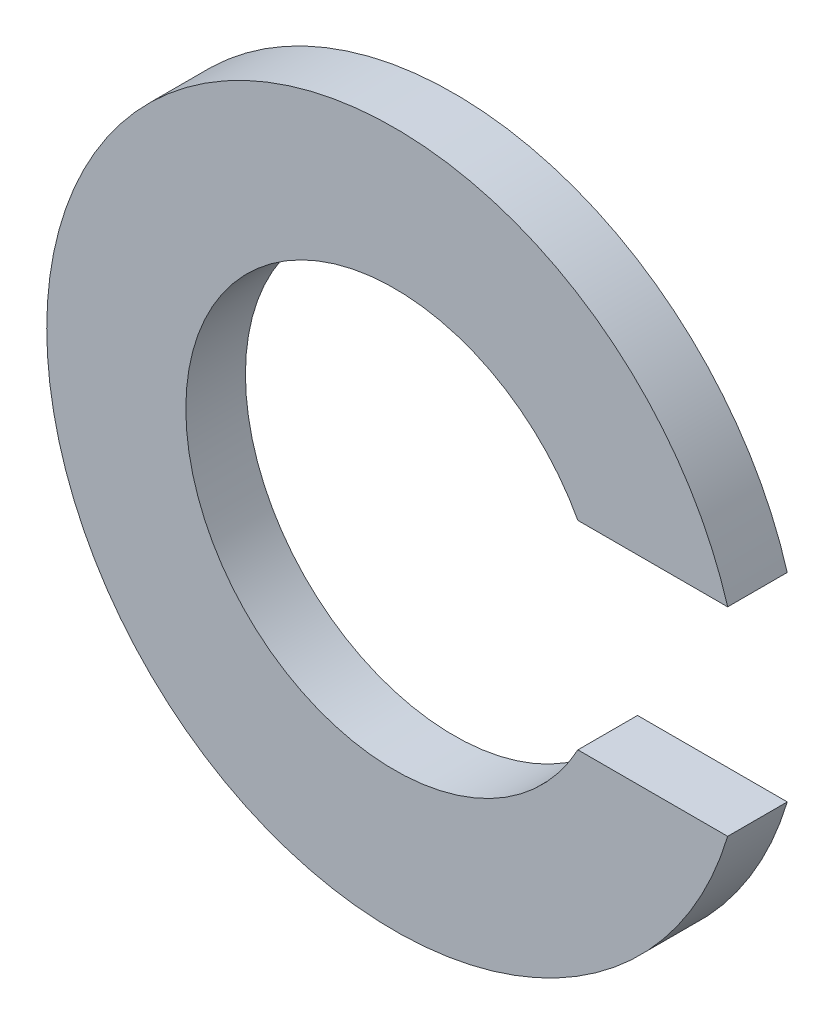
ISO-10303-21;
HEADER;
FILE_DESCRIPTION(('STEP AP214'),'2;1');
FILE_NAME('part.step','',(''),(''),'','','');
FILE_SCHEMA(('AUTOMOTIVE_DESIGN { 1 0 10303 214 1 1 1 1 }'));
ENDSEC;
DATA;
#1=APPLICATION_CONTEXT('core data for automotive mechanical design processes');
#2=APPLICATION_PROTOCOL_DEFINITION('international standard','automotive_design',2000,#1);
#3=PRODUCT_CONTEXT('',#1,'mechanical');
#4=PRODUCT('Part','Part','',(#3));
#5=PRODUCT_RELATED_PRODUCT_CATEGORY('part','',(#4));
#6=PRODUCT_DEFINITION_FORMATION('','',#4);
#7=PRODUCT_DEFINITION_CONTEXT('part definition',#1,'design');
#8=PRODUCT_DEFINITION('design','',#6,#7);
#9=PRODUCT_DEFINITION_SHAPE('','',#8);
#10=(LENGTH_UNIT() NAMED_UNIT(*) SI_UNIT(.MILLI.,.METRE.));
#11=(NAMED_UNIT(*) PLANE_ANGLE_UNIT() SI_UNIT($,.RADIAN.));
#12=(NAMED_UNIT(*) SI_UNIT($,.STERADIAN.) SOLID_ANGLE_UNIT());
#13=UNCERTAINTY_MEASURE_WITH_UNIT(LENGTH_MEASURE(1.E-05),#10,'distance_accuracy_value','');
#14=(GEOMETRIC_REPRESENTATION_CONTEXT(3) GLOBAL_UNCERTAINTY_ASSIGNED_CONTEXT((#13)) GLOBAL_UNIT_ASSIGNED_CONTEXT((#10,
#11,#12)) REPRESENTATION_CONTEXT('',''));
#15=CARTESIAN_POINT('',(0.,0.,0.));
#16=DIRECTION('',(0.,0.,1.));
#17=DIRECTION('',(1.,0.,0.));
#18=AXIS2_PLACEMENT_3D('',#15,#16,#17);
#19=CARTESIAN_POINT('',(0.,0.,0.6));
#20=DIRECTION('',(0.,0.,-1.));
#21=DIRECTION('',(-1.,0.,0.));
#22=AXIS2_PLACEMENT_3D('',#19,#20,#21);
#23=CYLINDRICAL_SURFACE('',#22,2.1);
#24=CARTESIAN_POINT('',(0.,0.,0.));
#25=DIRECTION('',(0.,0.,-1.));
#26=DIRECTION('',(1.,0.,0.));
#27=AXIS2_PLACEMENT_3D('',#24,#25,#26);
#28=CIRCLE('',#27,2.1);
#29=CARTESIAN_POINT('',(1.84661853126194,-1.,0.));
#30=VERTEX_POINT('',#29);
#31=CARTESIAN_POINT('',(1.84661853126194,1.,0.));
#32=VERTEX_POINT('',#31);
#33=EDGE_CURVE('E100',#30,#32,#28,.T.);
#34=ORIENTED_EDGE('',*,*,#33,.T.);
#35=DIRECTION('',(0.,0.,-1.));
#36=VECTOR('',#35,1.);
#37=CARTESIAN_POINT('',(1.84661853126194,1.,0.6));
#38=LINE('',#37,#36);
#39=CARTESIAN_POINT('',(1.84661853126194,1.,0.6));
#40=VERTEX_POINT('',#39);
#41=EDGE_CURVE('E11',#40,#32,#38,.T.);
#42=ORIENTED_EDGE('',*,*,#41,.F.);
#43=CARTESIAN_POINT('',(0.,0.,0.6));
#44=DIRECTION('',(0.,0.,-1.));
#45=DIRECTION('',(1.,0.,0.));
#46=AXIS2_PLACEMENT_3D('',#43,#44,#45);
#47=CIRCLE('',#46,2.1);
#48=CARTESIAN_POINT('',(1.84661853126194,-1.,0.6));
#49=VERTEX_POINT('',#48);
#50=EDGE_CURVE('E88',#49,#40,#47,.T.);
#51=ORIENTED_EDGE('',*,*,#50,.F.);
#52=DIRECTION('',(0.,0.,-1.));
#53=VECTOR('',#52,1.);
#54=CARTESIAN_POINT('',(1.84661853126194,-1.,0.6));
#55=LINE('',#54,#53);
#56=EDGE_CURVE('E96',#49,#30,#55,.T.);
#57=ORIENTED_EDGE('',*,*,#56,.T.);
#58=EDGE_LOOP('',(#34,#42,#51,#57));
#59=FACE_BOUND('',#58,.T.);
#60=ADVANCED_FACE('F37',(#59),#23,.F.);
#61=CARTESIAN_POINT('',(1.84661853126194,1.,0.6));
#62=DIRECTION('',(0.,1.,0.));
#63=DIRECTION('',(0.,0.,1.));
#64=AXIS2_PLACEMENT_3D('',#61,#62,#63);
#65=PLANE('',#64);
#66=DIRECTION('',(1.,0.,0.));
#67=VECTOR('',#66,1.);
#68=CARTESIAN_POINT('',(1.84661853126194,1.,0.));
#69=LINE('',#68,#67);
#70=CARTESIAN_POINT('',(3.35410196624968,1.,0.));
#71=VERTEX_POINT('',#70);
#72=EDGE_CURVE('E92',#32,#71,#69,.T.);
#73=ORIENTED_EDGE('',*,*,#72,.T.);
#74=DIRECTION('',(0.,0.,-1.));
#75=VECTOR('',#74,1.);
#76=CARTESIAN_POINT('',(3.35410196624968,1.,0.6));
#77=LINE('',#76,#75);
#78=CARTESIAN_POINT('',(3.35410196624968,1.,0.6));
#79=VERTEX_POINT('',#78);
#80=EDGE_CURVE('E45',#79,#71,#77,.T.);
#81=ORIENTED_EDGE('',*,*,#80,.F.);
#82=DIRECTION('',(1.,0.,0.));
#83=VECTOR('',#82,1.);
#84=CARTESIAN_POINT('',(1.84661853126194,1.,0.6));
#85=LINE('',#84,#83);
#86=EDGE_CURVE('E83',#40,#79,#85,.T.);
#87=ORIENTED_EDGE('',*,*,#86,.F.);
#88=ORIENTED_EDGE('',*,*,#41,.T.);
#89=EDGE_LOOP('',(#73,#81,#87,#88));
#90=FACE_BOUND('',#89,.T.);
#91=ADVANCED_FACE('F91',(#90),#65,.F.);
#92=CARTESIAN_POINT('',(0.,0.,0.6));
#93=DIRECTION('',(0.,0.,-1.));
#94=DIRECTION('',(-1.,0.,0.));
#95=AXIS2_PLACEMENT_3D('',#92,#93,#94);
#96=CYLINDRICAL_SURFACE('',#95,3.5);
#97=CARTESIAN_POINT('',(0.,0.,0.));
#98=DIRECTION('',(0.,0.,1.));
#99=DIRECTION('',(1.,0.,0.));
#100=AXIS2_PLACEMENT_3D('',#97,#98,#99);
#101=CIRCLE('',#100,3.5);
#102=CARTESIAN_POINT('',(3.35410196624968,-1.,0.));
#103=VERTEX_POINT('',#102);
#104=EDGE_CURVE('E70',#71,#103,#101,.T.);
#105=ORIENTED_EDGE('',*,*,#104,.T.);
#106=DIRECTION('',(0.,0.,-1.));
#107=VECTOR('',#106,1.);
#108=CARTESIAN_POINT('',(3.35410196624968,-1.,0.6));
#109=LINE('',#108,#107);
#110=CARTESIAN_POINT('',(3.35410196624968,-1.,0.6));
#111=VERTEX_POINT('',#110);
#112=EDGE_CURVE('E93',#111,#103,#109,.T.);
#113=ORIENTED_EDGE('',*,*,#112,.F.);
#114=CARTESIAN_POINT('',(0.,0.,0.6));
#115=DIRECTION('',(0.,0.,1.));
#116=DIRECTION('',(1.,0.,0.));
#117=AXIS2_PLACEMENT_3D('',#114,#115,#116);
#118=CIRCLE('',#117,3.5);
#119=EDGE_CURVE('E86',#79,#111,#118,.T.);
#120=ORIENTED_EDGE('',*,*,#119,.F.);
#121=ORIENTED_EDGE('',*,*,#80,.T.);
#122=EDGE_LOOP('',(#105,#113,#120,#121));
#123=FACE_BOUND('',#122,.T.);
#124=ADVANCED_FACE('F94',(#123),#96,.T.);
#125=CARTESIAN_POINT('',(1.84661853126194,-1.,0.6));
#126=DIRECTION('',(0.,-1.,0.));
#127=DIRECTION('',(0.,0.,-1.));
#128=AXIS2_PLACEMENT_3D('',#125,#126,#127);
#129=PLANE('',#128);
#130=DIRECTION('',(-1.,0.,0.));
#131=VECTOR('',#130,1.);
#132=CARTESIAN_POINT('',(1.84661853126194,-1.,0.));
#133=LINE('',#132,#131);
#134=EDGE_CURVE('E76',#103,#30,#133,.T.);
#135=ORIENTED_EDGE('',*,*,#134,.T.);
#136=ORIENTED_EDGE('',*,*,#56,.F.);
#137=DIRECTION('',(-1.,0.,0.));
#138=VECTOR('',#137,1.);
#139=CARTESIAN_POINT('',(1.84661853126194,-1.,0.6));
#140=LINE('',#139,#138);
#141=EDGE_CURVE('E53',#111,#49,#140,.T.);
#142=ORIENTED_EDGE('',*,*,#141,.F.);
#143=ORIENTED_EDGE('',*,*,#112,.T.);
#144=EDGE_LOOP('',(#135,#136,#142,#143));
#145=FACE_BOUND('',#144,.T.);
#146=ADVANCED_FACE('F107',(#145),#129,.F.);
#147=CARTESIAN_POINT('',(0.,0.,0.6));
#148=DIRECTION('',(0.,0.,1.));
#149=DIRECTION('',(1.,0.,0.));
#150=AXIS2_PLACEMENT_3D('',#147,#148,#149);
#151=PLANE('',#150);
#152=ORIENTED_EDGE('',*,*,#50,.T.);
#153=ORIENTED_EDGE('',*,*,#86,.T.);
#154=ORIENTED_EDGE('',*,*,#119,.T.);
#155=ORIENTED_EDGE('',*,*,#141,.T.);
#156=EDGE_LOOP('',(#152,#153,#154,#155));
#157=FACE_BOUND('',#156,.T.);
#158=ADVANCED_FACE('F84',(#157),#151,.T.);
#159=CARTESIAN_POINT('',(0.,0.,0.));
#160=DIRECTION('',(0.,0.,1.));
#161=DIRECTION('',(1.,0.,0.));
#162=AXIS2_PLACEMENT_3D('',#159,#160,#161);
#163=PLANE('',#162);
#164=ORIENTED_EDGE('',*,*,#33,.F.);
#165=ORIENTED_EDGE('',*,*,#134,.F.);
#166=ORIENTED_EDGE('',*,*,#104,.F.);
#167=ORIENTED_EDGE('',*,*,#72,.F.);
#168=EDGE_LOOP('',(#164,#165,#166,#167));
#169=FACE_BOUND('',#168,.T.);
#170=ADVANCED_FACE('F110',(#169),#163,.F.);
#171=CLOSED_SHELL('',(#60,#91,#124,#146,#158,#170));
#172=MANIFOLD_SOLID_BREP('B2',#171);
#173=ADVANCED_BREP_SHAPE_REPRESENTATION('',(#18,#172),#14);
#174=SHAPE_DEFINITION_REPRESENTATION(#9,#173);
ENDSEC;
END-ISO-10303-21;
